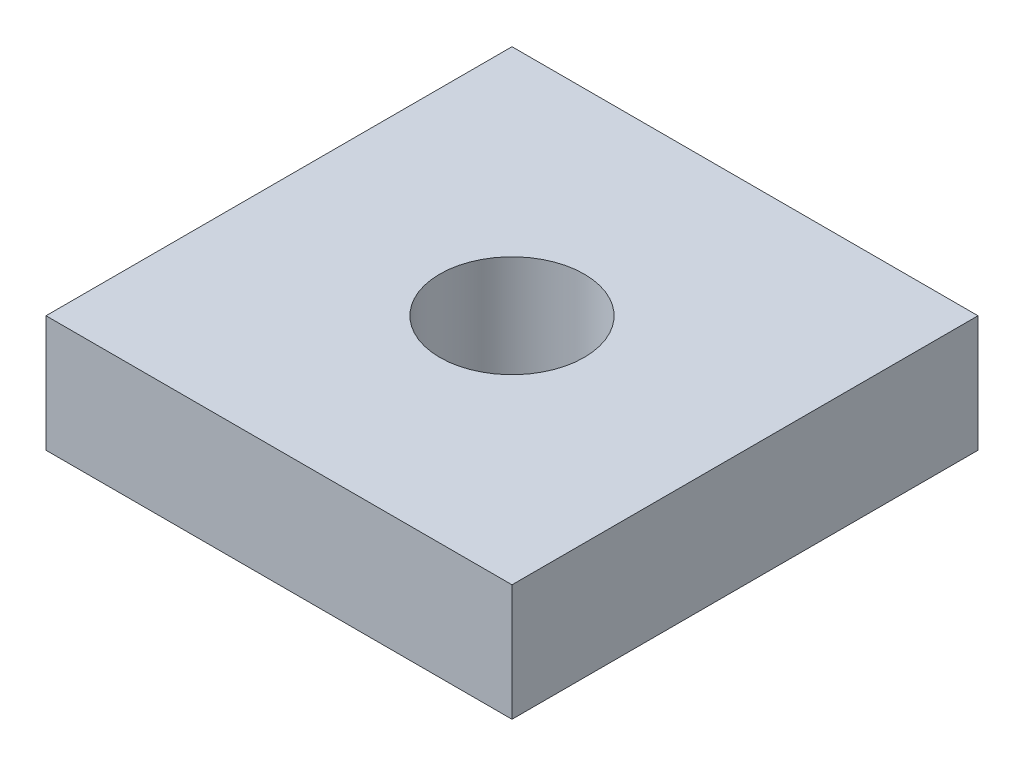
ISO-10303-21;
HEADER;
FILE_DESCRIPTION(('STEP AP214'),'2;1');
FILE_NAME('part.step','',(''),(''),'','','');
FILE_SCHEMA(('AUTOMOTIVE_DESIGN { 1 0 10303 214 1 1 1 1 }'));
ENDSEC;
DATA;
#1=APPLICATION_CONTEXT('core data for automotive mechanical design processes');
#2=APPLICATION_PROTOCOL_DEFINITION('international standard','automotive_design',2000,#1);
#3=PRODUCT_CONTEXT('',#1,'mechanical');
#4=PRODUCT('Part','Part','',(#3));
#5=PRODUCT_RELATED_PRODUCT_CATEGORY('part','',(#4));
#6=PRODUCT_DEFINITION_FORMATION('','',#4);
#7=PRODUCT_DEFINITION_CONTEXT('part definition',#1,'design');
#8=PRODUCT_DEFINITION('design','',#6,#7);
#9=PRODUCT_DEFINITION_SHAPE('','',#8);
#10=(LENGTH_UNIT() NAMED_UNIT(*) SI_UNIT(.MILLI.,.METRE.));
#11=(NAMED_UNIT(*) PLANE_ANGLE_UNIT() SI_UNIT($,.RADIAN.));
#12=(NAMED_UNIT(*) SI_UNIT($,.STERADIAN.) SOLID_ANGLE_UNIT());
#13=UNCERTAINTY_MEASURE_WITH_UNIT(LENGTH_MEASURE(1.E-05),#10,'distance_accuracy_value','');
#14=(GEOMETRIC_REPRESENTATION_CONTEXT(3) GLOBAL_UNCERTAINTY_ASSIGNED_CONTEXT((#13)) GLOBAL_UNIT_ASSIGNED_CONTEXT((#10,
#11,#12)) REPRESENTATION_CONTEXT('',''));
#15=CARTESIAN_POINT('',(0.,0.,0.));
#16=DIRECTION('',(0.,0.,1.));
#17=DIRECTION('',(1.,0.,0.));
#18=AXIS2_PLACEMENT_3D('',#15,#16,#17);
#19=CARTESIAN_POINT('',(0.,12.7,0.));
#20=DIRECTION('',(0.,-1.,0.));
#21=DIRECTION('',(0.,0.,-1.));
#22=AXIS2_PLACEMENT_3D('',#19,#20,#21);
#23=PLANE('',#22);
#24=DIRECTION('',(0.,0.,1.));
#25=VECTOR('',#24,1.);
#26=CARTESIAN_POINT('',(0.,12.7,0.));
#27=LINE('',#26,#25);
#28=CARTESIAN_POINT('',(0.,12.7,-50.8));
#29=VERTEX_POINT('',#28);
#30=CARTESIAN_POINT('',(0.,12.7,0.));
#31=VERTEX_POINT('',#30);
#32=EDGE_CURVE('E85',#29,#31,#27,.T.);
#33=ORIENTED_EDGE('',*,*,#32,.T.);
#34=DIRECTION('',(1.,0.,0.));
#35=VECTOR('',#34,1.);
#36=CARTESIAN_POINT('',(0.,12.7,0.));
#37=LINE('',#36,#35);
#38=CARTESIAN_POINT('',(50.8,12.7,0.));
#39=VERTEX_POINT('',#38);
#40=EDGE_CURVE('E80',#31,#39,#37,.T.);
#41=ORIENTED_EDGE('',*,*,#40,.T.);
#42=DIRECTION('',(0.,0.,-1.));
#43=VECTOR('',#42,1.);
#44=CARTESIAN_POINT('',(50.8,12.7,0.));
#45=LINE('',#44,#43);
#46=CARTESIAN_POINT('',(50.8,12.7,-50.8));
#47=VERTEX_POINT('',#46);
#48=EDGE_CURVE('E83',#39,#47,#45,.T.);
#49=ORIENTED_EDGE('',*,*,#48,.T.);
#50=DIRECTION('',(-1.,0.,0.));
#51=VECTOR('',#50,1.);
#52=CARTESIAN_POINT('',(0.,12.7,-50.8));
#53=LINE('',#52,#51);
#54=EDGE_CURVE('E50',#47,#29,#53,.T.);
#55=ORIENTED_EDGE('',*,*,#54,.T.);
#56=EDGE_LOOP('',(#33,#41,#49,#55));
#57=FACE_BOUND('',#56,.T.);
#58=CARTESIAN_POINT('',(25.4,12.7,-25.4));
#59=DIRECTION('',(0.,1.,0.));
#60=DIRECTION('',(0.,0.,1.));
#61=AXIS2_PLACEMENT_3D('',#58,#59,#60);
#62=CIRCLE('',#61,7.874);
#63=CARTESIAN_POINT('',(25.4,12.7,-17.526));
#64=VERTEX_POINT('',#63);
#65=EDGE_CURVE('E100',#64,#64,#62,.T.);
#66=ORIENTED_EDGE('',*,*,#65,.F.);
#67=EDGE_LOOP('',(#66));
#68=FACE_BOUND('',#67,.T.);
#69=ADVANCED_FACE('F33',(#57,#68),#23,.F.);
#70=CARTESIAN_POINT('',(0.,0.,0.));
#71=DIRECTION('',(0.,-1.,0.));
#72=DIRECTION('',(0.,0.,-1.));
#73=AXIS2_PLACEMENT_3D('',#70,#71,#72);
#74=PLANE('',#73);
#75=DIRECTION('',(0.,0.,1.));
#76=VECTOR('',#75,1.);
#77=CARTESIAN_POINT('',(0.,0.,0.));
#78=LINE('',#77,#76);
#79=CARTESIAN_POINT('',(0.,0.,-50.8));
#80=VERTEX_POINT('',#79);
#81=CARTESIAN_POINT('',(0.,0.,0.));
#82=VERTEX_POINT('',#81);
#83=EDGE_CURVE('E97',#80,#82,#78,.T.);
#84=ORIENTED_EDGE('',*,*,#83,.F.);
#85=DIRECTION('',(-1.,0.,0.));
#86=VECTOR('',#85,1.);
#87=CARTESIAN_POINT('',(0.,0.,-50.8));
#88=LINE('',#87,#86);
#89=CARTESIAN_POINT('',(50.8,0.,-50.8));
#90=VERTEX_POINT('',#89);
#91=EDGE_CURVE('E73',#90,#80,#88,.T.);
#92=ORIENTED_EDGE('',*,*,#91,.F.);
#93=DIRECTION('',(0.,0.,-1.));
#94=VECTOR('',#93,1.);
#95=CARTESIAN_POINT('',(50.8,0.,0.));
#96=LINE('',#95,#94);
#97=CARTESIAN_POINT('',(50.8,0.,0.));
#98=VERTEX_POINT('',#97);
#99=EDGE_CURVE('E67',#98,#90,#96,.T.);
#100=ORIENTED_EDGE('',*,*,#99,.F.);
#101=DIRECTION('',(1.,0.,0.));
#102=VECTOR('',#101,1.);
#103=CARTESIAN_POINT('',(0.,0.,0.));
#104=LINE('',#103,#102);
#105=EDGE_CURVE('E89',#82,#98,#104,.T.);
#106=ORIENTED_EDGE('',*,*,#105,.F.);
#107=EDGE_LOOP('',(#84,#92,#100,#106));
#108=FACE_BOUND('',#107,.T.);
#109=CARTESIAN_POINT('',(25.4,0.,-25.4));
#110=DIRECTION('',(0.,1.,0.));
#111=DIRECTION('',(0.,0.,1.));
#112=AXIS2_PLACEMENT_3D('',#109,#110,#111);
#113=CIRCLE('',#112,7.874);
#114=CARTESIAN_POINT('',(25.4,0.,-17.526));
#115=VERTEX_POINT('',#114);
#116=EDGE_CURVE('E112',#115,#115,#113,.T.);
#117=ORIENTED_EDGE('',*,*,#116,.T.);
#118=EDGE_LOOP('',(#117));
#119=FACE_BOUND('',#118,.T.);
#120=ADVANCED_FACE('F108',(#108,#119),#74,.T.);
#121=CARTESIAN_POINT('',(0.,12.7,0.));
#122=DIRECTION('',(1.,0.,0.));
#123=DIRECTION('',(0.,0.,-1.));
#124=AXIS2_PLACEMENT_3D('',#121,#122,#123);
#125=PLANE('',#124);
#126=ORIENTED_EDGE('',*,*,#83,.T.);
#127=DIRECTION('',(0.,-1.,0.));
#128=VECTOR('',#127,1.);
#129=CARTESIAN_POINT('',(0.,12.7,0.));
#130=LINE('',#129,#128);
#131=EDGE_CURVE('E11',#31,#82,#130,.T.);
#132=ORIENTED_EDGE('',*,*,#131,.F.);
#133=ORIENTED_EDGE('',*,*,#32,.F.);
#134=DIRECTION('',(0.,-1.,0.));
#135=VECTOR('',#134,1.);
#136=CARTESIAN_POINT('',(0.,12.7,-50.8));
#137=LINE('',#136,#135);
#138=EDGE_CURVE('E93',#29,#80,#137,.T.);
#139=ORIENTED_EDGE('',*,*,#138,.T.);
#140=EDGE_LOOP('',(#126,#132,#133,#139));
#141=FACE_BOUND('',#140,.T.);
#142=ADVANCED_FACE('F35',(#141),#125,.F.);
#143=CARTESIAN_POINT('',(0.,12.7,0.));
#144=DIRECTION('',(0.,0.,-1.));
#145=DIRECTION('',(-1.,0.,0.));
#146=AXIS2_PLACEMENT_3D('',#143,#144,#145);
#147=PLANE('',#146);
#148=ORIENTED_EDGE('',*,*,#105,.T.);
#149=DIRECTION('',(0.,-1.,0.));
#150=VECTOR('',#149,1.);
#151=CARTESIAN_POINT('',(50.8,12.7,0.));
#152=LINE('',#151,#150);
#153=EDGE_CURVE('E42',#39,#98,#152,.T.);
#154=ORIENTED_EDGE('',*,*,#153,.F.);
#155=ORIENTED_EDGE('',*,*,#40,.F.);
#156=ORIENTED_EDGE('',*,*,#131,.T.);
#157=EDGE_LOOP('',(#148,#154,#155,#156));
#158=FACE_BOUND('',#157,.T.);
#159=ADVANCED_FACE('F88',(#158),#147,.F.);
#160=CARTESIAN_POINT('',(50.8,12.7,0.));
#161=DIRECTION('',(-1.,0.,0.));
#162=DIRECTION('',(0.,0.,1.));
#163=AXIS2_PLACEMENT_3D('',#160,#161,#162);
#164=PLANE('',#163);
#165=ORIENTED_EDGE('',*,*,#99,.T.);
#166=DIRECTION('',(0.,-1.,0.));
#167=VECTOR('',#166,1.);
#168=CARTESIAN_POINT('',(50.8,12.7,-50.8));
#169=LINE('',#168,#167);
#170=EDGE_CURVE('E90',#47,#90,#169,.T.);
#171=ORIENTED_EDGE('',*,*,#170,.F.);
#172=ORIENTED_EDGE('',*,*,#48,.F.);
#173=ORIENTED_EDGE('',*,*,#153,.T.);
#174=EDGE_LOOP('',(#165,#171,#172,#173));
#175=FACE_BOUND('',#174,.T.);
#176=ADVANCED_FACE('F91',(#175),#164,.F.);
#177=CARTESIAN_POINT('',(0.,12.7,-50.8));
#178=DIRECTION('',(0.,0.,1.));
#179=DIRECTION('',(1.,0.,0.));
#180=AXIS2_PLACEMENT_3D('',#177,#178,#179);
#181=PLANE('',#180);
#182=ORIENTED_EDGE('',*,*,#91,.T.);
#183=ORIENTED_EDGE('',*,*,#138,.F.);
#184=ORIENTED_EDGE('',*,*,#54,.F.);
#185=ORIENTED_EDGE('',*,*,#170,.T.);
#186=EDGE_LOOP('',(#182,#183,#184,#185));
#187=FACE_BOUND('',#186,.T.);
#188=ADVANCED_FACE('F105',(#187),#181,.F.);
#189=CARTESIAN_POINT('',(25.4,12.7,-25.4));
#190=DIRECTION('',(0.,-1.,0.));
#191=DIRECTION('',(0.,0.,-1.));
#192=AXIS2_PLACEMENT_3D('',#189,#190,#191);
#193=CYLINDRICAL_SURFACE('',#192,7.874);
#194=ORIENTED_EDGE('',*,*,#65,.T.);
#195=EDGE_LOOP('',(#194));
#196=FACE_BOUND('',#195,.T.);
#197=ORIENTED_EDGE('',*,*,#116,.F.);
#198=EDGE_LOOP('',(#197));
#199=FACE_BOUND('',#198,.T.);
#200=ADVANCED_FACE('F118',(#196,#199),#193,.F.);
#201=CLOSED_SHELL('',(#69,#120,#142,#159,#176,#188,#200));
#202=MANIFOLD_SOLID_BREP('B2',#201);
#203=ADVANCED_BREP_SHAPE_REPRESENTATION('',(#18,#202),#14);
#204=SHAPE_DEFINITION_REPRESENTATION(#9,#203);
ENDSEC;
END-ISO-10303-21;
